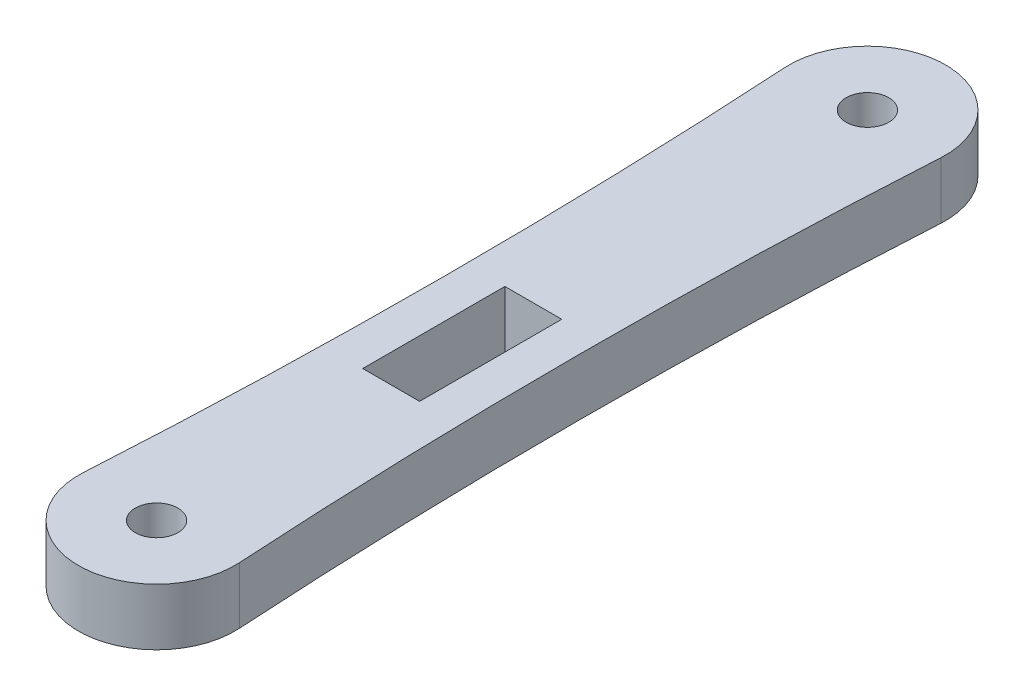
ISO-10303-21;
HEADER;
FILE_DESCRIPTION(('STEP AP214'),'2;1');
FILE_NAME('part.step','',(''),(''),'','','');
FILE_SCHEMA(('AUTOMOTIVE_DESIGN { 1 0 10303 214 1 1 1 1 }'));
ENDSEC;
DATA;
#1=APPLICATION_CONTEXT('core data for automotive mechanical design processes');
#2=APPLICATION_PROTOCOL_DEFINITION('international standard','automotive_design',2000,#1);
#3=PRODUCT_CONTEXT('',#1,'mechanical');
#4=PRODUCT('Part','Part','',(#3));
#5=PRODUCT_RELATED_PRODUCT_CATEGORY('part','',(#4));
#6=PRODUCT_DEFINITION_FORMATION('','',#4);
#7=PRODUCT_DEFINITION_CONTEXT('part definition',#1,'design');
#8=PRODUCT_DEFINITION('design','',#6,#7);
#9=PRODUCT_DEFINITION_SHAPE('','',#8);
#10=(LENGTH_UNIT() NAMED_UNIT(*) SI_UNIT(.MILLI.,.METRE.));
#11=(NAMED_UNIT(*) PLANE_ANGLE_UNIT() SI_UNIT($,.RADIAN.));
#12=(NAMED_UNIT(*) SI_UNIT($,.STERADIAN.) SOLID_ANGLE_UNIT());
#13=UNCERTAINTY_MEASURE_WITH_UNIT(LENGTH_MEASURE(1.E-05),#10,'distance_accuracy_value','');
#14=(GEOMETRIC_REPRESENTATION_CONTEXT(3) GLOBAL_UNCERTAINTY_ASSIGNED_CONTEXT((#13)) GLOBAL_UNIT_ASSIGNED_CONTEXT((#10,
#11,#12)) REPRESENTATION_CONTEXT('',''));
#15=CARTESIAN_POINT('',(0.,0.,0.));
#16=DIRECTION('',(0.,0.,1.));
#17=DIRECTION('',(1.,0.,0.));
#18=AXIS2_PLACEMENT_3D('',#15,#16,#17);
#19=CARTESIAN_POINT('',(-208.145833333333,4.,-12.4999999999999));
#20=DIRECTION('',(0.,-1.,0.));
#21=DIRECTION('',(0.,0.,-1.));
#22=AXIS2_PLACEMENT_3D('',#19,#20,#21);
#23=PLANE('',#22);
#24=CARTESIAN_POINT('',(0.,4.,-50.));
#25=DIRECTION('',(0.,1.,0.));
#26=DIRECTION('',(0.,0.,1.));
#27=AXIS2_PLACEMENT_3D('',#24,#25,#26);
#28=CIRCLE('',#27,1.5);
#29=CARTESIAN_POINT('',(0.,4.,-48.5));
#30=VERTEX_POINT('',#29);
#31=EDGE_CURVE('E134',#30,#30,#28,.T.);
#32=ORIENTED_EDGE('',*,*,#31,.F.);
#33=EDGE_LOOP('',(#32));
#34=FACE_BOUND('',#33,.T.);
#35=CARTESIAN_POINT('',(0.,4.,0.));
#36=DIRECTION('',(0.,1.,0.));
#37=DIRECTION('',(0.,0.,1.));
#38=AXIS2_PLACEMENT_3D('',#35,#36,#37);
#39=CIRCLE('',#38,1.5);
#40=CARTESIAN_POINT('',(0.,4.,1.5));
#41=VERTEX_POINT('',#40);
#42=EDGE_CURVE('E140',#41,#41,#39,.T.);
#43=ORIENTED_EDGE('',*,*,#42,.F.);
#44=EDGE_LOOP('',(#43));
#45=FACE_BOUND('',#44,.T.);
#46=CARTESIAN_POINT('',(-416.291666666665,4.,-24.9999999999999));
#47=DIRECTION('',(0.,-1.,0.));
#48=DIRECTION('',(0.,0.,-1.));
#49=AXIS2_PLACEMENT_3D('',#46,#47,#48);
#50=CIRCLE('',#49,411.541666666665);
#51=CARTESIAN_POINT('',(-5.49010890198823,4.,-49.6702967329404));
#52=VERTEX_POINT('',#51);
#53=CARTESIAN_POINT('',(-5.49010890198823,4.,-0.329703267059639));
#54=VERTEX_POINT('',#53);
#55=EDGE_CURVE('E146',#52,#54,#50,.T.);
#56=ORIENTED_EDGE('',*,*,#55,.T.);
#57=CARTESIAN_POINT('',(0.,4.,0.));
#58=DIRECTION('',(0.,1.,0.));
#59=DIRECTION('',(0.,0.,1.));
#60=AXIS2_PLACEMENT_3D('',#57,#58,#59);
#61=CIRCLE('',#60,5.50000000000002);
#62=CARTESIAN_POINT('',(5.49010890198826,4.,-0.329703267059705));
#63=VERTEX_POINT('',#62);
#64=EDGE_CURVE('E149',#54,#63,#61,.T.);
#65=ORIENTED_EDGE('',*,*,#64,.T.);
#66=CARTESIAN_POINT('',(416.291666666665,4.,-24.9999999999999));
#67=DIRECTION('',(0.,-1.,0.));
#68=DIRECTION('',(0.,0.,1.));
#69=AXIS2_PLACEMENT_3D('',#66,#67,#68);
#70=CIRCLE('',#69,411.541666666665);
#71=CARTESIAN_POINT('',(5.49010890198821,4.,-49.6702967329404));
#72=VERTEX_POINT('',#71);
#73=EDGE_CURVE('E152',#63,#72,#70,.T.);
#74=ORIENTED_EDGE('',*,*,#73,.T.);
#75=CARTESIAN_POINT('',(0.,4.,-50.));
#76=DIRECTION('',(0.,1.,0.));
#77=DIRECTION('',(0.,0.,1.));
#78=AXIS2_PLACEMENT_3D('',#75,#76,#77);
#79=CIRCLE('',#78,5.50000000000001);
#80=EDGE_CURVE('E154',#72,#52,#79,.T.);
#81=ORIENTED_EDGE('',*,*,#80,.T.);
#82=EDGE_LOOP('',(#56,#65,#74,#81));
#83=FACE_BOUND('',#82,.T.);
#84=DIRECTION('',(0.,0.,1.));
#85=VECTOR('',#84,1.);
#86=CARTESIAN_POINT('',(-2.,4.,-26.5));
#87=LINE('',#86,#85);
#88=CARTESIAN_POINT('',(-2.,4.,-26.5));
#89=VERTEX_POINT('',#88);
#90=CARTESIAN_POINT('',(-2.,4.,-16.5));
#91=VERTEX_POINT('',#90);
#92=EDGE_CURVE('E98',#89,#91,#87,.T.);
#93=ORIENTED_EDGE('',*,*,#92,.F.);
#94=DIRECTION('',(-1.,0.,0.));
#95=VECTOR('',#94,1.);
#96=CARTESIAN_POINT('',(-2.,4.,-26.5));
#97=LINE('',#96,#95);
#98=CARTESIAN_POINT('',(2.,4.,-26.5));
#99=VERTEX_POINT('',#98);
#100=EDGE_CURVE('E120',#99,#89,#97,.T.);
#101=ORIENTED_EDGE('',*,*,#100,.F.);
#102=DIRECTION('',(0.,0.,-1.));
#103=VECTOR('',#102,1.);
#104=CARTESIAN_POINT('',(2.,4.,-26.5));
#105=LINE('',#104,#103);
#106=CARTESIAN_POINT('',(2.,4.,-16.5));
#107=VERTEX_POINT('',#106);
#108=EDGE_CURVE('E118',#107,#99,#105,.T.);
#109=ORIENTED_EDGE('',*,*,#108,.F.);
#110=DIRECTION('',(1.,0.,0.));
#111=VECTOR('',#110,1.);
#112=CARTESIAN_POINT('',(-2.,4.,-16.5));
#113=LINE('',#112,#111);
#114=EDGE_CURVE('E106',#91,#107,#113,.T.);
#115=ORIENTED_EDGE('',*,*,#114,.F.);
#116=EDGE_LOOP('',(#93,#101,#109,#115));
#117=FACE_BOUND('',#116,.T.);
#118=ADVANCED_FACE('F33',(#34,#45,#83,#117),#23,.F.);
#119=CARTESIAN_POINT('',(-208.145833333333,0.,-12.4999999999999));
#120=DIRECTION('',(0.,-1.,0.));
#121=DIRECTION('',(0.,0.,-1.));
#122=AXIS2_PLACEMENT_3D('',#119,#120,#121);
#123=PLANE('',#122);
#124=CARTESIAN_POINT('',(0.,0.,0.));
#125=DIRECTION('',(0.,1.,0.));
#126=DIRECTION('',(0.,0.,1.));
#127=AXIS2_PLACEMENT_3D('',#124,#125,#126);
#128=CIRCLE('',#127,1.5);
#129=CARTESIAN_POINT('',(0.,0.,1.5));
#130=VERTEX_POINT('',#129);
#131=EDGE_CURVE('E137',#130,#130,#128,.T.);
#132=ORIENTED_EDGE('',*,*,#131,.T.);
#133=EDGE_LOOP('',(#132));
#134=FACE_BOUND('',#133,.T.);
#135=CARTESIAN_POINT('',(-416.291666666665,0.,-24.9999999999999));
#136=DIRECTION('',(0.,-1.,0.));
#137=DIRECTION('',(0.,0.,-1.));
#138=AXIS2_PLACEMENT_3D('',#135,#136,#137);
#139=CIRCLE('',#138,411.541666666665);
#140=CARTESIAN_POINT('',(-5.49010890198823,0.,-49.6702967329404));
#141=VERTEX_POINT('',#140);
#142=CARTESIAN_POINT('',(-5.49010890198823,0.,-0.329703267059639));
#143=VERTEX_POINT('',#142);
#144=EDGE_CURVE('E143',#141,#143,#139,.T.);
#145=ORIENTED_EDGE('',*,*,#144,.F.);
#146=CARTESIAN_POINT('',(0.,0.,-50.));
#147=DIRECTION('',(0.,1.,0.));
#148=DIRECTION('',(0.,0.,1.));
#149=AXIS2_PLACEMENT_3D('',#146,#147,#148);
#150=CIRCLE('',#149,5.50000000000001);
#151=CARTESIAN_POINT('',(5.49010890198821,0.,-49.6702967329404));
#152=VERTEX_POINT('',#151);
#153=EDGE_CURVE('E150',#152,#141,#150,.T.);
#154=ORIENTED_EDGE('',*,*,#153,.F.);
#155=CARTESIAN_POINT('',(416.291666666665,0.,-24.9999999999999));
#156=DIRECTION('',(0.,-1.,0.));
#157=DIRECTION('',(0.,0.,1.));
#158=AXIS2_PLACEMENT_3D('',#155,#156,#157);
#159=CIRCLE('',#158,411.541666666665);
#160=CARTESIAN_POINT('',(5.49010890198826,0.,-0.329703267059705));
#161=VERTEX_POINT('',#160);
#162=EDGE_CURVE('E161',#161,#152,#159,.T.);
#163=ORIENTED_EDGE('',*,*,#162,.F.);
#164=CARTESIAN_POINT('',(0.,0.,0.));
#165=DIRECTION('',(0.,1.,0.));
#166=DIRECTION('',(0.,0.,1.));
#167=AXIS2_PLACEMENT_3D('',#164,#165,#166);
#168=CIRCLE('',#167,5.50000000000002);
#169=EDGE_CURVE('E159',#143,#161,#168,.T.);
#170=ORIENTED_EDGE('',*,*,#169,.F.);
#171=EDGE_LOOP('',(#145,#154,#163,#170));
#172=FACE_BOUND('',#171,.T.);
#173=CARTESIAN_POINT('',(0.,0.,-50.));
#174=DIRECTION('',(0.,1.,0.));
#175=DIRECTION('',(0.,0.,1.));
#176=AXIS2_PLACEMENT_3D('',#173,#174,#175);
#177=CIRCLE('',#176,1.5);
#178=CARTESIAN_POINT('',(0.,0.,-48.5));
#179=VERTEX_POINT('',#178);
#180=EDGE_CURVE('E114',#179,#179,#177,.T.);
#181=ORIENTED_EDGE('',*,*,#180,.T.);
#182=EDGE_LOOP('',(#181));
#183=FACE_BOUND('',#182,.T.);
#184=DIRECTION('',(-1.,0.,0.));
#185=VECTOR('',#184,1.);
#186=CARTESIAN_POINT('',(-2.,0.,-26.5));
#187=LINE('',#186,#185);
#188=CARTESIAN_POINT('',(2.,0.,-26.5));
#189=VERTEX_POINT('',#188);
#190=CARTESIAN_POINT('',(-2.,0.,-26.5));
#191=VERTEX_POINT('',#190);
#192=EDGE_CURVE('E107',#189,#191,#187,.T.);
#193=ORIENTED_EDGE('',*,*,#192,.T.);
#194=DIRECTION('',(0.,0.,1.));
#195=VECTOR('',#194,1.);
#196=CARTESIAN_POINT('',(-2.,0.,-26.5));
#197=LINE('',#196,#195);
#198=CARTESIAN_POINT('',(-2.,0.,-16.5));
#199=VERTEX_POINT('',#198);
#200=EDGE_CURVE('E56',#191,#199,#197,.T.);
#201=ORIENTED_EDGE('',*,*,#200,.T.);
#202=DIRECTION('',(1.,0.,0.));
#203=VECTOR('',#202,1.);
#204=CARTESIAN_POINT('',(-2.,0.,-16.5));
#205=LINE('',#204,#203);
#206=CARTESIAN_POINT('',(2.,0.,-16.5));
#207=VERTEX_POINT('',#206);
#208=EDGE_CURVE('E113',#199,#207,#205,.T.);
#209=ORIENTED_EDGE('',*,*,#208,.T.);
#210=DIRECTION('',(0.,0.,-1.));
#211=VECTOR('',#210,1.);
#212=CARTESIAN_POINT('',(2.,0.,-26.5));
#213=LINE('',#212,#211);
#214=EDGE_CURVE('E126',#207,#189,#213,.T.);
#215=ORIENTED_EDGE('',*,*,#214,.T.);
#216=EDGE_LOOP('',(#193,#201,#209,#215));
#217=FACE_BOUND('',#216,.T.);
#218=ADVANCED_FACE('F179',(#134,#172,#183,#217),#123,.T.);
#219=CARTESIAN_POINT('',(-416.291666666665,4.,-24.9999999999999));
#220=DIRECTION('',(0.,-1.,0.));
#221=DIRECTION('',(0.,0.,-1.));
#222=AXIS2_PLACEMENT_3D('',#219,#220,#221);
#223=CYLINDRICAL_SURFACE('',#222,411.541666666665);
#224=ORIENTED_EDGE('',*,*,#144,.T.);
#225=DIRECTION('',(0.,-1.,0.));
#226=VECTOR('',#225,1.);
#227=CARTESIAN_POINT('',(-5.49010890198823,4.,-0.329703267059639));
#228=LINE('',#227,#226);
#229=EDGE_CURVE('E11',#54,#143,#228,.T.);
#230=ORIENTED_EDGE('',*,*,#229,.F.);
#231=ORIENTED_EDGE('',*,*,#55,.F.);
#232=DIRECTION('',(0.,-1.,0.));
#233=VECTOR('',#232,1.);
#234=CARTESIAN_POINT('',(-5.49010890198823,4.,-49.6702967329404));
#235=LINE('',#234,#233);
#236=EDGE_CURVE('E156',#52,#141,#235,.T.);
#237=ORIENTED_EDGE('',*,*,#236,.T.);
#238=EDGE_LOOP('',(#224,#230,#231,#237));
#239=FACE_BOUND('',#238,.T.);
#240=ADVANCED_FACE('F35',(#239),#223,.F.);
#241=CARTESIAN_POINT('',(0.,4.,0.));
#242=DIRECTION('',(0.,-1.,0.));
#243=DIRECTION('',(0.,0.,-1.));
#244=AXIS2_PLACEMENT_3D('',#241,#242,#243);
#245=CYLINDRICAL_SURFACE('',#244,5.50000000000002);
#246=ORIENTED_EDGE('',*,*,#169,.T.);
#247=DIRECTION('',(0.,-1.,0.));
#248=VECTOR('',#247,1.);
#249=CARTESIAN_POINT('',(5.49010890198826,4.,-0.329703267059705));
#250=LINE('',#249,#248);
#251=EDGE_CURVE('E41',#63,#161,#250,.T.);
#252=ORIENTED_EDGE('',*,*,#251,.F.);
#253=ORIENTED_EDGE('',*,*,#64,.F.);
#254=ORIENTED_EDGE('',*,*,#229,.T.);
#255=EDGE_LOOP('',(#246,#252,#253,#254));
#256=FACE_BOUND('',#255,.T.);
#257=ADVANCED_FACE('F189',(#256),#245,.T.);
#258=CARTESIAN_POINT('',(416.291666666665,4.,-24.9999999999999));
#259=DIRECTION('',(0.,-1.,0.));
#260=DIRECTION('',(0.,0.,-1.));
#261=AXIS2_PLACEMENT_3D('',#258,#259,#260);
#262=CYLINDRICAL_SURFACE('',#261,411.541666666665);
#263=ORIENTED_EDGE('',*,*,#162,.T.);
#264=DIRECTION('',(0.,-1.,0.));
#265=VECTOR('',#264,1.);
#266=CARTESIAN_POINT('',(5.49010890198821,4.,-49.6702967329404));
#267=LINE('',#266,#265);
#268=EDGE_CURVE('E166',#72,#152,#267,.T.);
#269=ORIENTED_EDGE('',*,*,#268,.F.);
#270=ORIENTED_EDGE('',*,*,#73,.F.);
#271=ORIENTED_EDGE('',*,*,#251,.T.);
#272=EDGE_LOOP('',(#263,#269,#270,#271));
#273=FACE_BOUND('',#272,.T.);
#274=ADVANCED_FACE('F173',(#273),#262,.F.);
#275=CARTESIAN_POINT('',(0.,4.,-50.));
#276=DIRECTION('',(0.,-1.,0.));
#277=DIRECTION('',(0.,0.,-1.));
#278=AXIS2_PLACEMENT_3D('',#275,#276,#277);
#279=CYLINDRICAL_SURFACE('',#278,5.50000000000001);
#280=ORIENTED_EDGE('',*,*,#153,.T.);
#281=ORIENTED_EDGE('',*,*,#236,.F.);
#282=ORIENTED_EDGE('',*,*,#80,.F.);
#283=ORIENTED_EDGE('',*,*,#268,.T.);
#284=EDGE_LOOP('',(#280,#281,#282,#283));
#285=FACE_BOUND('',#284,.T.);
#286=ADVANCED_FACE('F183',(#285),#279,.T.);
#287=CARTESIAN_POINT('',(0.,4.,0.));
#288=DIRECTION('',(0.,-1.,0.));
#289=DIRECTION('',(0.,0.,-1.));
#290=AXIS2_PLACEMENT_3D('',#287,#288,#289);
#291=CYLINDRICAL_SURFACE('',#290,1.5);
#292=ORIENTED_EDGE('',*,*,#42,.T.);
#293=EDGE_LOOP('',(#292));
#294=FACE_BOUND('',#293,.T.);
#295=ORIENTED_EDGE('',*,*,#131,.F.);
#296=EDGE_LOOP('',(#295));
#297=FACE_BOUND('',#296,.T.);
#298=ADVANCED_FACE('F207',(#294,#297),#291,.F.);
#299=CARTESIAN_POINT('',(0.,4.,-50.));
#300=DIRECTION('',(0.,-1.,0.));
#301=DIRECTION('',(0.,0.,-1.));
#302=AXIS2_PLACEMENT_3D('',#299,#300,#301);
#303=CYLINDRICAL_SURFACE('',#302,1.5);
#304=ORIENTED_EDGE('',*,*,#31,.T.);
#305=EDGE_LOOP('',(#304));
#306=FACE_BOUND('',#305,.T.);
#307=ORIENTED_EDGE('',*,*,#180,.F.);
#308=EDGE_LOOP('',(#307));
#309=FACE_BOUND('',#308,.T.);
#310=ADVANCED_FACE('F214',(#306,#309),#303,.F.);
#311=CARTESIAN_POINT('',(-2.,4.,-26.5));
#312=DIRECTION('',(1.,0.,0.));
#313=DIRECTION('',(0.,0.,-1.));
#314=AXIS2_PLACEMENT_3D('',#311,#312,#313);
#315=PLANE('',#314);
#316=ORIENTED_EDGE('',*,*,#200,.F.);
#317=DIRECTION('',(0.,-1.,0.));
#318=VECTOR('',#317,1.);
#319=CARTESIAN_POINT('',(-2.,4.,-26.5));
#320=LINE('',#319,#318);
#321=EDGE_CURVE('E102',#89,#191,#320,.T.);
#322=ORIENTED_EDGE('',*,*,#321,.F.);
#323=ORIENTED_EDGE('',*,*,#92,.T.);
#324=DIRECTION('',(0.,-1.,0.));
#325=VECTOR('',#324,1.);
#326=CARTESIAN_POINT('',(-2.,4.,-16.5));
#327=LINE('',#326,#325);
#328=EDGE_CURVE('E101',#91,#199,#327,.T.);
#329=ORIENTED_EDGE('',*,*,#328,.T.);
#330=EDGE_LOOP('',(#316,#322,#323,#329));
#331=FACE_BOUND('',#330,.T.);
#332=ADVANCED_FACE('F100',(#331),#315,.T.);
#333=CARTESIAN_POINT('',(-2.,4.,-16.5));
#334=DIRECTION('',(0.,0.,-1.));
#335=DIRECTION('',(-1.,0.,0.));
#336=AXIS2_PLACEMENT_3D('',#333,#334,#335);
#337=PLANE('',#336);
#338=ORIENTED_EDGE('',*,*,#208,.F.);
#339=ORIENTED_EDGE('',*,*,#328,.F.);
#340=ORIENTED_EDGE('',*,*,#114,.T.);
#341=DIRECTION('',(0.,-1.,0.));
#342=VECTOR('',#341,1.);
#343=CARTESIAN_POINT('',(2.,4.,-16.5));
#344=LINE('',#343,#342);
#345=EDGE_CURVE('E115',#107,#207,#344,.T.);
#346=ORIENTED_EDGE('',*,*,#345,.T.);
#347=EDGE_LOOP('',(#338,#339,#340,#346));
#348=FACE_BOUND('',#347,.T.);
#349=ADVANCED_FACE('F110',(#348),#337,.T.);
#350=CARTESIAN_POINT('',(2.,4.,-26.5));
#351=DIRECTION('',(-1.,0.,0.));
#352=DIRECTION('',(0.,0.,1.));
#353=AXIS2_PLACEMENT_3D('',#350,#351,#352);
#354=PLANE('',#353);
#355=ORIENTED_EDGE('',*,*,#214,.F.);
#356=ORIENTED_EDGE('',*,*,#345,.F.);
#357=ORIENTED_EDGE('',*,*,#108,.T.);
#358=DIRECTION('',(0.,-1.,0.));
#359=VECTOR('',#358,1.);
#360=CARTESIAN_POINT('',(2.,4.,-26.5));
#361=LINE('',#360,#359);
#362=EDGE_CURVE('E48',#99,#189,#361,.T.);
#363=ORIENTED_EDGE('',*,*,#362,.T.);
#364=EDGE_LOOP('',(#355,#356,#357,#363));
#365=FACE_BOUND('',#364,.T.);
#366=ADVANCED_FACE('F231',(#365),#354,.T.);
#367=CARTESIAN_POINT('',(-2.,4.,-26.5));
#368=DIRECTION('',(0.,0.,1.));
#369=DIRECTION('',(1.,0.,0.));
#370=AXIS2_PLACEMENT_3D('',#367,#368,#369);
#371=PLANE('',#370);
#372=ORIENTED_EDGE('',*,*,#192,.F.);
#373=ORIENTED_EDGE('',*,*,#362,.F.);
#374=ORIENTED_EDGE('',*,*,#100,.T.);
#375=ORIENTED_EDGE('',*,*,#321,.T.);
#376=EDGE_LOOP('',(#372,#373,#374,#375));
#377=FACE_BOUND('',#376,.T.);
#378=ADVANCED_FACE('F234',(#377),#371,.T.);
#379=CLOSED_SHELL('',(#118,#218,#240,#257,#274,#286,#298,#310,#332,#349,#366,#378));
#380=MANIFOLD_SOLID_BREP('B2',#379);
#381=ADVANCED_BREP_SHAPE_REPRESENTATION('',(#18,#380),#14);
#382=SHAPE_DEFINITION_REPRESENTATION(#9,#381);
ENDSEC;
END-ISO-10303-21;
